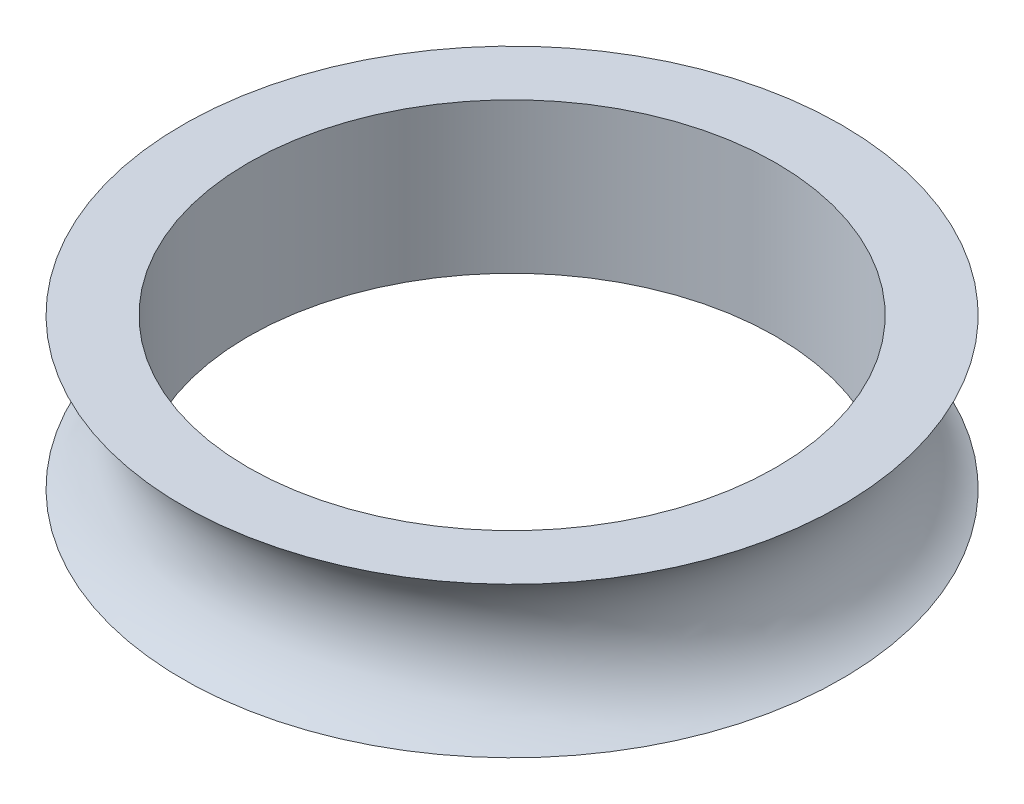
ISO-10303-21;
HEADER;
FILE_DESCRIPTION(('STEP AP214'),'2;1');
FILE_NAME('part.step','',(''),(''),'','','');
FILE_SCHEMA(('AUTOMOTIVE_DESIGN { 1 0 10303 214 1 1 1 1 }'));
ENDSEC;
DATA;
#1=APPLICATION_CONTEXT('core data for automotive mechanical design processes');
#2=APPLICATION_PROTOCOL_DEFINITION('international standard','automotive_design',2000,#1);
#3=PRODUCT_CONTEXT('',#1,'mechanical');
#4=PRODUCT('Part','Part','',(#3));
#5=PRODUCT_RELATED_PRODUCT_CATEGORY('part','',(#4));
#6=PRODUCT_DEFINITION_FORMATION('','',#4);
#7=PRODUCT_DEFINITION_CONTEXT('part definition',#1,'design');
#8=PRODUCT_DEFINITION('design','',#6,#7);
#9=PRODUCT_DEFINITION_SHAPE('','',#8);
#10=(LENGTH_UNIT() NAMED_UNIT(*) SI_UNIT(.MILLI.,.METRE.));
#11=(NAMED_UNIT(*) PLANE_ANGLE_UNIT() SI_UNIT($,.RADIAN.));
#12=(NAMED_UNIT(*) SI_UNIT($,.STERADIAN.) SOLID_ANGLE_UNIT());
#13=UNCERTAINTY_MEASURE_WITH_UNIT(LENGTH_MEASURE(1.E-05),#10,'distance_accuracy_value','');
#14=(GEOMETRIC_REPRESENTATION_CONTEXT(3) GLOBAL_UNCERTAINTY_ASSIGNED_CONTEXT((#13)) GLOBAL_UNIT_ASSIGNED_CONTEXT((#10,
#11,#12)) REPRESENTATION_CONTEXT('',''));
#15=CARTESIAN_POINT('',(0.,0.,0.));
#16=DIRECTION('',(0.,0.,1.));
#17=DIRECTION('',(1.,0.,0.));
#18=AXIS2_PLACEMENT_3D('',#15,#16,#17);
#19=CARTESIAN_POINT('',(0.,0.,0.));
#20=DIRECTION('',(0.,-1.,0.));
#21=DIRECTION('',(0.,0.,-1.));
#22=AXIS2_PLACEMENT_3D('',#19,#20,#21);
#23=CYLINDRICAL_SURFACE('',#22,14.05);
#24=CARTESIAN_POINT('',(0.,0.,0.));
#25=DIRECTION('',(0.,-1.,0.));
#26=DIRECTION('',(0.,0.,-1.));
#27=AXIS2_PLACEMENT_3D('',#24,#25,#26);
#28=CIRCLE('',#27,14.05);
#29=CARTESIAN_POINT('',(0.,0.,-14.05));
#30=VERTEX_POINT('',#29);
#31=EDGE_CURVE('E10',#30,#30,#28,.T.);
#32=ORIENTED_EDGE('',*,*,#31,.T.);
#33=EDGE_LOOP('',(#32));
#34=FACE_BOUND('',#33,.T.);
#35=CARTESIAN_POINT('',(0.,8.,0.));
#36=DIRECTION('',(0.,-1.,0.));
#37=DIRECTION('',(0.,0.,-1.));
#38=AXIS2_PLACEMENT_3D('',#35,#36,#37);
#39=CIRCLE('',#38,14.05);
#40=CARTESIAN_POINT('',(0.,8.,-14.05));
#41=VERTEX_POINT('',#40);
#42=EDGE_CURVE('E54',#41,#41,#39,.T.);
#43=ORIENTED_EDGE('',*,*,#42,.F.);
#44=EDGE_LOOP('',(#43));
#45=FACE_BOUND('',#44,.T.);
#46=ADVANCED_FACE('F37',(#34,#45),#23,.F.);
#47=CARTESIAN_POINT('',(14.05,0.,0.));
#48=DIRECTION('',(0.,-1.,0.));
#49=DIRECTION('',(0.,0.,-1.));
#50=AXIS2_PLACEMENT_3D('',#47,#48,#49);
#51=PLANE('',#50);
#52=CARTESIAN_POINT('',(0.,0.,0.));
#53=DIRECTION('',(0.,-1.,0.));
#54=DIRECTION('',(0.,0.,-1.));
#55=AXIS2_PLACEMENT_3D('',#52,#53,#54);
#56=CIRCLE('',#55,17.55);
#57=CARTESIAN_POINT('',(0.,0.,-17.55));
#58=VERTEX_POINT('',#57);
#59=EDGE_CURVE('E44',#58,#58,#56,.T.);
#60=ORIENTED_EDGE('',*,*,#59,.T.);
#61=EDGE_LOOP('',(#60));
#62=FACE_BOUND('',#61,.T.);
#63=ORIENTED_EDGE('',*,*,#31,.F.);
#64=EDGE_LOOP('',(#63));
#65=FACE_BOUND('',#64,.T.);
#66=ADVANCED_FACE('F65',(#62,#65),#51,.T.);
#67=CARTESIAN_POINT('',(0.,4.,0.));
#68=DIRECTION('',(0.,-1.,0.));
#69=DIRECTION('',(0.,0.,-1.));
#70=AXIS2_PLACEMENT_3D('',#67,#68,#69);
#71=TOROIDAL_SURFACE('',#70,19.6115528128088,4.5);
#72=CARTESIAN_POINT('',(0.,8.,0.));
#73=DIRECTION('',(0.,-1.,0.));
#74=DIRECTION('',(0.,0.,-1.));
#75=AXIS2_PLACEMENT_3D('',#72,#73,#74);
#76=CIRCLE('',#75,17.55);
#77=CARTESIAN_POINT('',(0.,8.,-17.55));
#78=VERTEX_POINT('',#77);
#79=EDGE_CURVE('E49',#78,#78,#76,.T.);
#80=ORIENTED_EDGE('',*,*,#79,.T.);
#81=EDGE_LOOP('',(#80));
#82=FACE_BOUND('',#81,.T.);
#83=ORIENTED_EDGE('',*,*,#59,.F.);
#84=EDGE_LOOP('',(#83));
#85=FACE_BOUND('',#84,.T.);
#86=ADVANCED_FACE('F69',(#82,#85),#71,.F.);
#87=CARTESIAN_POINT('',(14.05,8.,0.));
#88=DIRECTION('',(0.,1.,0.));
#89=DIRECTION('',(0.,0.,1.));
#90=AXIS2_PLACEMENT_3D('',#87,#88,#89);
#91=PLANE('',#90);
#92=ORIENTED_EDGE('',*,*,#42,.T.);
#93=EDGE_LOOP('',(#92));
#94=FACE_BOUND('',#93,.T.);
#95=ORIENTED_EDGE('',*,*,#79,.F.);
#96=EDGE_LOOP('',(#95));
#97=FACE_BOUND('',#96,.T.);
#98=ADVANCED_FACE('F61',(#94,#97),#91,.T.);
#99=CLOSED_SHELL('',(#46,#66,#86,#98));
#100=MANIFOLD_SOLID_BREP('B2',#99);
#101=ADVANCED_BREP_SHAPE_REPRESENTATION('',(#18,#100),#14);
#102=SHAPE_DEFINITION_REPRESENTATION(#9,#101);
ENDSEC;
END-ISO-10303-21;
